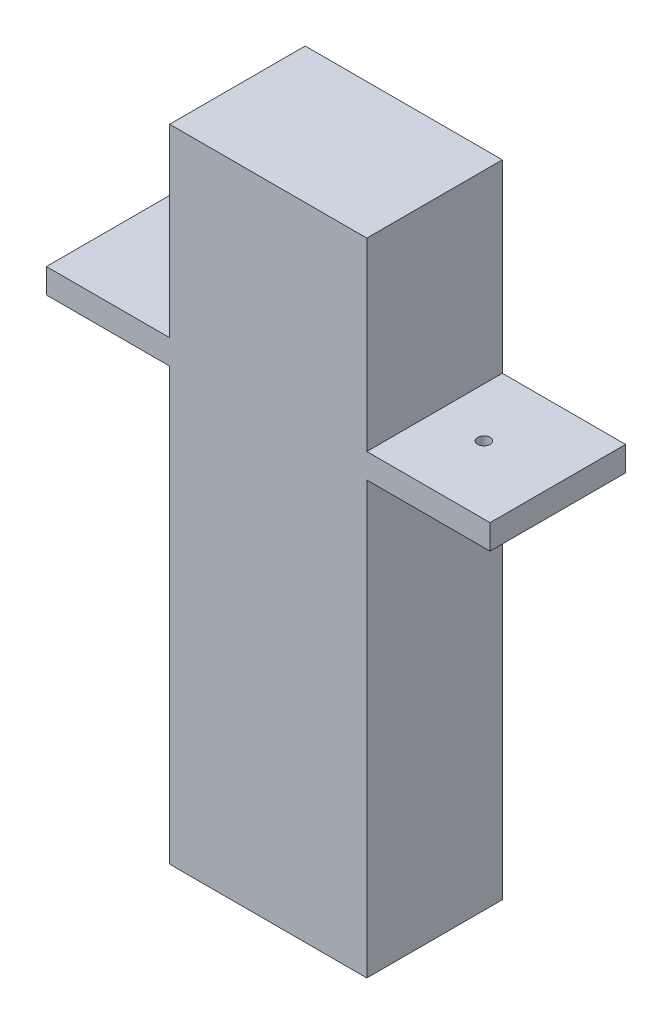
ISO-10303-21;
HEADER;
FILE_DESCRIPTION(('STEP AP214'),'2;1');
FILE_NAME('part.step','',(''),(''),'','','');
FILE_SCHEMA(('AUTOMOTIVE_DESIGN { 1 0 10303 214 1 1 1 1 }'));
ENDSEC;
DATA;
#1=APPLICATION_CONTEXT('core data for automotive mechanical design processes');
#2=APPLICATION_PROTOCOL_DEFINITION('international standard','automotive_design',2000,#1);
#3=PRODUCT_CONTEXT('',#1,'mechanical');
#4=PRODUCT('Part','Part','',(#3));
#5=PRODUCT_RELATED_PRODUCT_CATEGORY('part','',(#4));
#6=PRODUCT_DEFINITION_FORMATION('','',#4);
#7=PRODUCT_DEFINITION_CONTEXT('part definition',#1,'design');
#8=PRODUCT_DEFINITION('design','',#6,#7);
#9=PRODUCT_DEFINITION_SHAPE('','',#8);
#10=(LENGTH_UNIT() NAMED_UNIT(*) SI_UNIT(.MILLI.,.METRE.));
#11=(NAMED_UNIT(*) PLANE_ANGLE_UNIT() SI_UNIT($,.RADIAN.));
#12=(NAMED_UNIT(*) SI_UNIT($,.STERADIAN.) SOLID_ANGLE_UNIT());
#13=UNCERTAINTY_MEASURE_WITH_UNIT(LENGTH_MEASURE(1.E-05),#10,'distance_accuracy_value','');
#14=(GEOMETRIC_REPRESENTATION_CONTEXT(3) GLOBAL_UNCERTAINTY_ASSIGNED_CONTEXT((#13)) GLOBAL_UNIT_ASSIGNED_CONTEXT((#10,
#11,#12)) REPRESENTATION_CONTEXT('',''));
#15=CARTESIAN_POINT('',(0.,0.,0.));
#16=DIRECTION('',(0.,0.,1.));
#17=DIRECTION('',(1.,0.,0.));
#18=AXIS2_PLACEMENT_3D('',#15,#16,#17);
#19=CARTESIAN_POINT('',(8.,0.,9.));
#20=DIRECTION('',(-1.,0.,0.));
#21=DIRECTION('',(0.,0.,1.));
#22=AXIS2_PLACEMENT_3D('',#19,#20,#21);
#23=PLANE('',#22);
#24=DIRECTION('',(0.,1.,0.));
#25=VECTOR('',#24,1.);
#26=CARTESIAN_POINT('',(8.,0.,0.));
#27=LINE('',#26,#25);
#28=CARTESIAN_POINT('',(8.,-25.,0.));
#29=VERTEX_POINT('',#28);
#30=CARTESIAN_POINT('',(8.,10.,0.));
#31=VERTEX_POINT('',#30);
#32=EDGE_CURVE('E263',#29,#31,#27,.T.);
#33=ORIENTED_EDGE('',*,*,#32,.T.);
#34=DIRECTION('',(0.,0.,1.));
#35=VECTOR('',#34,1.);
#36=CARTESIAN_POINT('',(8.,10.,0.));
#37=LINE('',#36,#35);
#38=CARTESIAN_POINT('',(8.,10.,11.));
#39=VERTEX_POINT('',#38);
#40=EDGE_CURVE('E175',#31,#39,#37,.T.);
#41=ORIENTED_EDGE('',*,*,#40,.T.);
#42=DIRECTION('',(0.,1.,0.));
#43=VECTOR('',#42,1.);
#44=CARTESIAN_POINT('',(8.,27.,11.));
#45=LINE('',#44,#43);
#46=CARTESIAN_POINT('',(8.,-25.,11.));
#47=VERTEX_POINT('',#46);
#48=EDGE_CURVE('E240',#47,#39,#45,.T.);
#49=ORIENTED_EDGE('',*,*,#48,.F.);
#50=DIRECTION('',(0.,0.,-1.));
#51=VECTOR('',#50,1.);
#52=CARTESIAN_POINT('',(8.,-25.,9.));
#53=LINE('',#52,#51);
#54=EDGE_CURVE('E50',#47,#29,#53,.T.);
#55=ORIENTED_EDGE('',*,*,#54,.T.);
#56=EDGE_LOOP('',(#33,#41,#49,#55));
#57=FACE_BOUND('',#56,.T.);
#58=ADVANCED_FACE('F41',(#57),#23,.F.);
#59=CARTESIAN_POINT('',(-8.,0.,9.));
#60=DIRECTION('',(-1.,0.,0.));
#61=DIRECTION('',(0.,0.,1.));
#62=AXIS2_PLACEMENT_3D('',#59,#60,#61);
#63=PLANE('',#62);
#64=DIRECTION('',(0.,0.,-1.));
#65=VECTOR('',#64,1.);
#66=CARTESIAN_POINT('',(-8.,12.,0.));
#67=LINE('',#66,#65);
#68=CARTESIAN_POINT('',(-7.99999999999999,12.,11.));
#69=VERTEX_POINT('',#68);
#70=CARTESIAN_POINT('',(-8.,12.,0.));
#71=VERTEX_POINT('',#70);
#72=EDGE_CURVE('E65',#69,#71,#67,.T.);
#73=ORIENTED_EDGE('',*,*,#72,.F.);
#74=DIRECTION('',(0.,-1.,0.));
#75=VECTOR('',#74,1.);
#76=CARTESIAN_POINT('',(-8.,27.,11.));
#77=LINE('',#76,#75);
#78=CARTESIAN_POINT('',(-8.,27.,11.));
#79=VERTEX_POINT('',#78);
#80=EDGE_CURVE('E233',#79,#69,#77,.T.);
#81=ORIENTED_EDGE('',*,*,#80,.F.);
#82=DIRECTION('',(0.,0.,-1.));
#83=VECTOR('',#82,1.);
#84=CARTESIAN_POINT('',(-8.,27.,9.));
#85=LINE('',#84,#83);
#86=CARTESIAN_POINT('',(-8.,27.,0.));
#87=VERTEX_POINT('',#86);
#88=EDGE_CURVE('E289',#79,#87,#85,.T.);
#89=ORIENTED_EDGE('',*,*,#88,.T.);
#90=DIRECTION('',(0.,1.,0.));
#91=VECTOR('',#90,1.);
#92=CARTESIAN_POINT('',(-8.,0.,0.));
#93=LINE('',#92,#91);
#94=EDGE_CURVE('E268',#71,#87,#93,.T.);
#95=ORIENTED_EDGE('',*,*,#94,.F.);
#96=EDGE_LOOP('',(#73,#81,#89,#95));
#97=FACE_BOUND('',#96,.T.);
#98=ADVANCED_FACE('F343',(#97),#63,.T.);
#99=CARTESIAN_POINT('',(8.,12.,11.));
#100=VERTEX_POINT('',#99);
#101=CARTESIAN_POINT('',(8.,27.,11.));
#102=VERTEX_POINT('',#101);
#103=EDGE_CURVE('E239',#100,#102,#45,.T.);
#104=ORIENTED_EDGE('',*,*,#103,.F.);
#105=DIRECTION('',(0.,0.,-1.));
#106=VECTOR('',#105,1.);
#107=CARTESIAN_POINT('',(8.,12.,0.));
#108=LINE('',#107,#106);
#109=CARTESIAN_POINT('',(8.,12.,0.));
#110=VERTEX_POINT('',#109);
#111=EDGE_CURVE('E185',#100,#110,#108,.T.);
#112=ORIENTED_EDGE('',*,*,#111,.T.);
#113=CARTESIAN_POINT('',(8.,27.,0.));
#114=VERTEX_POINT('',#113);
#115=EDGE_CURVE('E163',#110,#114,#27,.T.);
#116=ORIENTED_EDGE('',*,*,#115,.T.);
#117=DIRECTION('',(0.,0.,-1.));
#118=VECTOR('',#117,1.);
#119=CARTESIAN_POINT('',(8.,27.,9.));
#120=LINE('',#119,#118);
#121=EDGE_CURVE('E292',#102,#114,#120,.T.);
#122=ORIENTED_EDGE('',*,*,#121,.F.);
#123=EDGE_LOOP('',(#104,#112,#116,#122));
#124=FACE_BOUND('',#123,.T.);
#125=ADVANCED_FACE('F43',(#124),#23,.F.);
#126=CARTESIAN_POINT('',(0.,27.,9.));
#127=DIRECTION('',(0.,1.,0.));
#128=DIRECTION('',(-1.,0.,0.));
#129=AXIS2_PLACEMENT_3D('',#126,#127,#128);
#130=PLANE('',#129);
#131=DIRECTION('',(1.,0.,0.));
#132=VECTOR('',#131,1.);
#133=CARTESIAN_POINT('',(0.,27.,0.));
#134=LINE('',#133,#132);
#135=EDGE_CURVE('E266',#87,#114,#134,.T.);
#136=ORIENTED_EDGE('',*,*,#135,.F.);
#137=ORIENTED_EDGE('',*,*,#88,.F.);
#138=DIRECTION('',(-1.,0.,0.));
#139=VECTOR('',#138,1.);
#140=CARTESIAN_POINT('',(-8.,27.,11.));
#141=LINE('',#140,#139);
#142=EDGE_CURVE('E243',#102,#79,#141,.T.);
#143=ORIENTED_EDGE('',*,*,#142,.F.);
#144=ORIENTED_EDGE('',*,*,#121,.T.);
#145=EDGE_LOOP('',(#136,#137,#143,#144));
#146=FACE_BOUND('',#145,.T.);
#147=ADVANCED_FACE('F349',(#146),#130,.T.);
#148=DIRECTION('',(0.,0.,1.));
#149=VECTOR('',#148,1.);
#150=CARTESIAN_POINT('',(-8.,10.,0.));
#151=LINE('',#150,#149);
#152=CARTESIAN_POINT('',(-8.,10.,0.));
#153=VERTEX_POINT('',#152);
#154=CARTESIAN_POINT('',(-8.,10.,11.));
#155=VERTEX_POINT('',#154);
#156=EDGE_CURVE('E198',#153,#155,#151,.T.);
#157=ORIENTED_EDGE('',*,*,#156,.F.);
#158=CARTESIAN_POINT('',(-8.,-25.,0.));
#159=VERTEX_POINT('',#158);
#160=EDGE_CURVE('E269',#159,#153,#93,.T.);
#161=ORIENTED_EDGE('',*,*,#160,.F.);
#162=DIRECTION('',(0.,0.,-1.));
#163=VECTOR('',#162,1.);
#164=CARTESIAN_POINT('',(-8.,-25.,9.));
#165=LINE('',#164,#163);
#166=CARTESIAN_POINT('',(-7.99999999999999,-25.,11.));
#167=VERTEX_POINT('',#166);
#168=EDGE_CURVE('E287',#167,#159,#165,.T.);
#169=ORIENTED_EDGE('',*,*,#168,.F.);
#170=EDGE_CURVE('E236',#155,#167,#77,.T.);
#171=ORIENTED_EDGE('',*,*,#170,.F.);
#172=EDGE_LOOP('',(#157,#161,#169,#171));
#173=FACE_BOUND('',#172,.T.);
#174=ADVANCED_FACE('F315',(#173),#63,.T.);
#175=CARTESIAN_POINT('',(0.,-25.,9.));
#176=DIRECTION('',(0.,1.,0.));
#177=DIRECTION('',(0.,0.,1.));
#178=AXIS2_PLACEMENT_3D('',#175,#176,#177);
#179=PLANE('',#178);
#180=DIRECTION('',(1.,0.,0.));
#181=VECTOR('',#180,1.);
#182=CARTESIAN_POINT('',(0.,-25.,0.));
#183=LINE('',#182,#181);
#184=CARTESIAN_POINT('',(-6.,-25.,0.));
#185=VERTEX_POINT('',#184);
#186=EDGE_CURVE('E262',#159,#185,#183,.T.);
#187=ORIENTED_EDGE('',*,*,#186,.T.);
#188=DIRECTION('',(0.,0.,-1.));
#189=VECTOR('',#188,1.);
#190=CARTESIAN_POINT('',(-6.,-25.,9.));
#191=LINE('',#190,#189);
#192=CARTESIAN_POINT('',(-6.,-25.,9.));
#193=VERTEX_POINT('',#192);
#194=EDGE_CURVE('E285',#193,#185,#191,.T.);
#195=ORIENTED_EDGE('',*,*,#194,.F.);
#196=DIRECTION('',(1.,0.,0.));
#197=VECTOR('',#196,1.);
#198=CARTESIAN_POINT('',(-7.99999999999999,-25.,9.));
#199=LINE('',#198,#197);
#200=CARTESIAN_POINT('',(6.,-25.,9.));
#201=VERTEX_POINT('',#200);
#202=EDGE_CURVE('E232',#193,#201,#199,.T.);
#203=ORIENTED_EDGE('',*,*,#202,.T.);
#204=DIRECTION('',(0.,0.,-1.));
#205=VECTOR('',#204,1.);
#206=CARTESIAN_POINT('',(6.,-25.,9.));
#207=LINE('',#206,#205);
#208=CARTESIAN_POINT('',(6.,-25.,0.));
#209=VERTEX_POINT('',#208);
#210=EDGE_CURVE('E259',#201,#209,#207,.T.);
#211=ORIENTED_EDGE('',*,*,#210,.T.);
#212=EDGE_CURVE('E246',#209,#29,#183,.T.);
#213=ORIENTED_EDGE('',*,*,#212,.T.);
#214=ORIENTED_EDGE('',*,*,#54,.F.);
#215=DIRECTION('',(1.,0.,0.));
#216=VECTOR('',#215,1.);
#217=CARTESIAN_POINT('',(-7.99999999999999,-25.,11.));
#218=LINE('',#217,#216);
#219=EDGE_CURVE('E235',#167,#47,#218,.T.);
#220=ORIENTED_EDGE('',*,*,#219,.F.);
#221=ORIENTED_EDGE('',*,*,#168,.T.);
#222=EDGE_LOOP('',(#187,#195,#203,#211,#213,#214,#220,#221));
#223=FACE_BOUND('',#222,.T.);
#224=ADVANCED_FACE('F301',(#223),#179,.F.);
#225=CARTESIAN_POINT('',(-6.,0.,9.));
#226=DIRECTION('',(1.,0.,0.));
#227=DIRECTION('',(0.,1.,0.));
#228=AXIS2_PLACEMENT_3D('',#225,#226,#227);
#229=PLANE('',#228);
#230=DIRECTION('',(0.,-1.,0.));
#231=VECTOR('',#230,1.);
#232=CARTESIAN_POINT('',(-6.,0.,0.));
#233=LINE('',#232,#231);
#234=CARTESIAN_POINT('',(-6.,25.,0.));
#235=VERTEX_POINT('',#234);
#236=EDGE_CURVE('E272',#235,#185,#233,.T.);
#237=ORIENTED_EDGE('',*,*,#236,.F.);
#238=DIRECTION('',(0.,0.,-1.));
#239=VECTOR('',#238,1.);
#240=CARTESIAN_POINT('',(-6.,25.,9.));
#241=LINE('',#240,#239);
#242=CARTESIAN_POINT('',(-6.,25.,9.));
#243=VERTEX_POINT('',#242);
#244=EDGE_CURVE('E283',#243,#235,#241,.T.);
#245=ORIENTED_EDGE('',*,*,#244,.F.);
#246=DIRECTION('',(0.,-1.,0.));
#247=VECTOR('',#246,1.);
#248=CARTESIAN_POINT('',(-6.,0.,9.));
#249=LINE('',#248,#247);
#250=EDGE_CURVE('E249',#243,#193,#249,.T.);
#251=ORIENTED_EDGE('',*,*,#250,.T.);
#252=ORIENTED_EDGE('',*,*,#194,.T.);
#253=EDGE_LOOP('',(#237,#245,#251,#252));
#254=FACE_BOUND('',#253,.T.);
#255=ADVANCED_FACE('F366',(#254),#229,.T.);
#256=CARTESIAN_POINT('',(0.,25.,9.));
#257=DIRECTION('',(0.,1.,0.));
#258=DIRECTION('',(0.,0.,1.));
#259=AXIS2_PLACEMENT_3D('',#256,#257,#258);
#260=PLANE('',#259);
#261=DIRECTION('',(1.,0.,0.));
#262=VECTOR('',#261,1.);
#263=CARTESIAN_POINT('',(0.,25.,0.));
#264=LINE('',#263,#262);
#265=CARTESIAN_POINT('',(6.,25.,0.));
#266=VERTEX_POINT('',#265);
#267=EDGE_CURVE('E275',#235,#266,#264,.T.);
#268=ORIENTED_EDGE('',*,*,#267,.T.);
#269=DIRECTION('',(0.,0.,-1.));
#270=VECTOR('',#269,1.);
#271=CARTESIAN_POINT('',(6.,25.,9.));
#272=LINE('',#271,#270);
#273=CARTESIAN_POINT('',(6.,25.,9.));
#274=VERTEX_POINT('',#273);
#275=EDGE_CURVE('E280',#274,#266,#272,.T.);
#276=ORIENTED_EDGE('',*,*,#275,.F.);
#277=DIRECTION('',(1.,0.,0.));
#278=VECTOR('',#277,1.);
#279=CARTESIAN_POINT('',(0.,25.,9.));
#280=LINE('',#279,#278);
#281=EDGE_CURVE('E252',#243,#274,#280,.T.);
#282=ORIENTED_EDGE('',*,*,#281,.F.);
#283=ORIENTED_EDGE('',*,*,#244,.T.);
#284=EDGE_LOOP('',(#268,#276,#282,#283));
#285=FACE_BOUND('',#284,.T.);
#286=ADVANCED_FACE('F369',(#285),#260,.F.);
#287=CARTESIAN_POINT('',(6.,0.,9.));
#288=DIRECTION('',(1.,0.,0.));
#289=DIRECTION('',(0.,1.,0.));
#290=AXIS2_PLACEMENT_3D('',#287,#288,#289);
#291=PLANE('',#290);
#292=DIRECTION('',(0.,-1.,0.));
#293=VECTOR('',#292,1.);
#294=CARTESIAN_POINT('',(6.,0.,0.));
#295=LINE('',#294,#293);
#296=EDGE_CURVE('E253',#266,#209,#295,.T.);
#297=ORIENTED_EDGE('',*,*,#296,.T.);
#298=ORIENTED_EDGE('',*,*,#210,.F.);
#299=DIRECTION('',(0.,-1.,0.));
#300=VECTOR('',#299,1.);
#301=CARTESIAN_POINT('',(6.,0.,9.));
#302=LINE('',#301,#300);
#303=EDGE_CURVE('E256',#274,#201,#302,.T.);
#304=ORIENTED_EDGE('',*,*,#303,.F.);
#305=ORIENTED_EDGE('',*,*,#275,.T.);
#306=EDGE_LOOP('',(#297,#298,#304,#305));
#307=FACE_BOUND('',#306,.T.);
#308=ADVANCED_FACE('F373',(#307),#291,.F.);
#309=CARTESIAN_POINT('',(0.,0.,0.));
#310=DIRECTION('',(0.,0.,1.));
#311=DIRECTION('',(1.,0.,0.));
#312=AXIS2_PLACEMENT_3D('',#309,#310,#311);
#313=PLANE('',#312);
#314=ORIENTED_EDGE('',*,*,#212,.F.);
#315=ORIENTED_EDGE('',*,*,#296,.F.);
#316=ORIENTED_EDGE('',*,*,#267,.F.);
#317=ORIENTED_EDGE('',*,*,#236,.T.);
#318=ORIENTED_EDGE('',*,*,#186,.F.);
#319=ORIENTED_EDGE('',*,*,#160,.T.);
#320=DIRECTION('',(1.,0.,0.));
#321=VECTOR('',#320,1.);
#322=CARTESIAN_POINT('',(-18.,10.,0.));
#323=LINE('',#322,#321);
#324=CARTESIAN_POINT('',(-18.,10.,0.));
#325=VERTEX_POINT('',#324);
#326=EDGE_CURVE('E220',#325,#153,#323,.T.);
#327=ORIENTED_EDGE('',*,*,#326,.F.);
#328=DIRECTION('',(0.,-1.,0.));
#329=VECTOR('',#328,1.);
#330=CARTESIAN_POINT('',(-18.,12.,0.));
#331=LINE('',#330,#329);
#332=CARTESIAN_POINT('',(-18.,12.,0.));
#333=VERTEX_POINT('',#332);
#334=EDGE_CURVE('E199',#333,#325,#331,.T.);
#335=ORIENTED_EDGE('',*,*,#334,.F.);
#336=DIRECTION('',(1.,0.,0.));
#337=VECTOR('',#336,1.);
#338=CARTESIAN_POINT('',(-18.,12.,0.));
#339=LINE('',#338,#337);
#340=EDGE_CURVE('E208',#333,#71,#339,.T.);
#341=ORIENTED_EDGE('',*,*,#340,.T.);
#342=ORIENTED_EDGE('',*,*,#94,.T.);
#343=ORIENTED_EDGE('',*,*,#135,.T.);
#344=ORIENTED_EDGE('',*,*,#115,.F.);
#345=DIRECTION('',(-1.,0.,0.));
#346=VECTOR('',#345,1.);
#347=CARTESIAN_POINT('',(18.,12.,0.));
#348=LINE('',#347,#346);
#349=CARTESIAN_POINT('',(18.,12.,0.));
#350=VERTEX_POINT('',#349);
#351=EDGE_CURVE('E57',#350,#110,#348,.T.);
#352=ORIENTED_EDGE('',*,*,#351,.F.);
#353=DIRECTION('',(0.,-1.,0.));
#354=VECTOR('',#353,1.);
#355=CARTESIAN_POINT('',(18.,12.,0.));
#356=LINE('',#355,#354);
#357=CARTESIAN_POINT('',(18.,10.,0.));
#358=VERTEX_POINT('',#357);
#359=EDGE_CURVE('E160',#350,#358,#356,.T.);
#360=ORIENTED_EDGE('',*,*,#359,.T.);
#361=DIRECTION('',(-1.,0.,0.));
#362=VECTOR('',#361,1.);
#363=CARTESIAN_POINT('',(18.,10.,0.));
#364=LINE('',#363,#362);
#365=EDGE_CURVE('E184',#358,#31,#364,.T.);
#366=ORIENTED_EDGE('',*,*,#365,.T.);
#367=ORIENTED_EDGE('',*,*,#32,.F.);
#368=EDGE_LOOP('',(#314,#315,#316,#317,#318,#319,#327,#335,#341,#342,#343,#344,#352,#360,#366,#367));
#369=FACE_BOUND('',#368,.T.);
#370=ADVANCED_FACE('F159',(#369),#313,.F.);
#371=CARTESIAN_POINT('',(0.,0.,11.));
#372=DIRECTION('',(0.,0.,1.));
#373=DIRECTION('',(1.,0.,0.));
#374=AXIS2_PLACEMENT_3D('',#371,#372,#373);
#375=PLANE('',#374);
#376=ORIENTED_EDGE('',*,*,#80,.T.);
#377=DIRECTION('',(1.,0.,0.));
#378=VECTOR('',#377,1.);
#379=CARTESIAN_POINT('',(-18.,12.,11.));
#380=LINE('',#379,#378);
#381=CARTESIAN_POINT('',(-18.,12.,11.));
#382=VERTEX_POINT('',#381);
#383=EDGE_CURVE('E214',#382,#69,#380,.T.);
#384=ORIENTED_EDGE('',*,*,#383,.F.);
#385=DIRECTION('',(0.,1.,0.));
#386=VECTOR('',#385,1.);
#387=CARTESIAN_POINT('',(-18.,12.,11.));
#388=LINE('',#387,#386);
#389=CARTESIAN_POINT('',(-18.,10.,11.));
#390=VERTEX_POINT('',#389);
#391=EDGE_CURVE('E204',#390,#382,#388,.T.);
#392=ORIENTED_EDGE('',*,*,#391,.F.);
#393=DIRECTION('',(1.,0.,0.));
#394=VECTOR('',#393,1.);
#395=CARTESIAN_POINT('',(-18.,10.,11.));
#396=LINE('',#395,#394);
#397=EDGE_CURVE('E217',#390,#155,#396,.T.);
#398=ORIENTED_EDGE('',*,*,#397,.T.);
#399=ORIENTED_EDGE('',*,*,#170,.T.);
#400=ORIENTED_EDGE('',*,*,#219,.T.);
#401=ORIENTED_EDGE('',*,*,#48,.T.);
#402=DIRECTION('',(-1.,0.,0.));
#403=VECTOR('',#402,1.);
#404=CARTESIAN_POINT('',(18.,10.,11.));
#405=LINE('',#404,#403);
#406=CARTESIAN_POINT('',(18.,10.,11.));
#407=VERTEX_POINT('',#406);
#408=EDGE_CURVE('E190',#407,#39,#405,.T.);
#409=ORIENTED_EDGE('',*,*,#408,.F.);
#410=DIRECTION('',(0.,1.,0.));
#411=VECTOR('',#410,1.);
#412=CARTESIAN_POINT('',(18.,12.,11.));
#413=LINE('',#412,#411);
#414=CARTESIAN_POINT('',(18.,12.,11.));
#415=VERTEX_POINT('',#414);
#416=EDGE_CURVE('E178',#407,#415,#413,.T.);
#417=ORIENTED_EDGE('',*,*,#416,.T.);
#418=DIRECTION('',(-1.,0.,0.));
#419=VECTOR('',#418,1.);
#420=CARTESIAN_POINT('',(18.,12.,11.));
#421=LINE('',#420,#419);
#422=EDGE_CURVE('E165',#415,#100,#421,.T.);
#423=ORIENTED_EDGE('',*,*,#422,.T.);
#424=ORIENTED_EDGE('',*,*,#103,.T.);
#425=ORIENTED_EDGE('',*,*,#142,.T.);
#426=EDGE_LOOP('',(#376,#384,#392,#398,#399,#400,#401,#409,#417,#423,#424,#425));
#427=FACE_BOUND('',#426,.T.);
#428=ADVANCED_FACE('F308',(#427),#375,.T.);
#429=CARTESIAN_POINT('',(0.,0.,9.));
#430=DIRECTION('',(0.,0.,1.));
#431=DIRECTION('',(1.,0.,0.));
#432=AXIS2_PLACEMENT_3D('',#429,#430,#431);
#433=PLANE('',#432);
#434=CARTESIAN_POINT('',(0.,4.,9.));
#435=DIRECTION('',(0.,0.,1.));
#436=DIRECTION('',(1.,0.,0.));
#437=AXIS2_PLACEMENT_3D('',#434,#435,#436);
#438=CIRCLE('',#437,1.75);
#439=CARTESIAN_POINT('',(1.75,4.,9.));
#440=VERTEX_POINT('',#439);
#441=EDGE_CURVE('E11',#440,#440,#438,.F.);
#442=ORIENTED_EDGE('',*,*,#441,.F.);
#443=EDGE_LOOP('',(#442));
#444=FACE_BOUND('',#443,.T.);
#445=ORIENTED_EDGE('',*,*,#250,.F.);
#446=ORIENTED_EDGE('',*,*,#281,.T.);
#447=ORIENTED_EDGE('',*,*,#303,.T.);
#448=ORIENTED_EDGE('',*,*,#202,.F.);
#449=EDGE_LOOP('',(#445,#446,#447,#448));
#450=FACE_BOUND('',#449,.T.);
#451=ADVANCED_FACE('F379',(#444,#450),#433,.F.);
#452=CARTESIAN_POINT('',(0.,4.,4.));
#453=DIRECTION('',(0.,0.,1.));
#454=DIRECTION('',(1.,0.,0.));
#455=AXIS2_PLACEMENT_3D('',#452,#453,#454);
#456=CYLINDRICAL_SURFACE('',#455,1.75);
#457=CARTESIAN_POINT('',(0.,4.,4.));
#458=DIRECTION('',(0.,0.,-1.));
#459=DIRECTION('',(-1.,0.,0.));
#460=AXIS2_PLACEMENT_3D('',#457,#458,#459);
#461=CIRCLE('',#460,1.75);
#462=CARTESIAN_POINT('',(-1.75,4.,4.));
#463=VERTEX_POINT('',#462);
#464=EDGE_CURVE('E227',#463,#463,#461,.T.);
#465=ORIENTED_EDGE('',*,*,#464,.F.);
#466=EDGE_LOOP('',(#465));
#467=FACE_BOUND('',#466,.T.);
#468=ORIENTED_EDGE('',*,*,#441,.T.);
#469=EDGE_LOOP('',(#468));
#470=FACE_BOUND('',#469,.T.);
#471=ADVANCED_FACE('F382',(#467,#470),#456,.T.);
#472=CARTESIAN_POINT('',(0.,4.,4.));
#473=DIRECTION('',(0.,0.,-1.));
#474=DIRECTION('',(-1.,0.,0.));
#475=AXIS2_PLACEMENT_3D('',#472,#473,#474);
#476=PLANE('',#475);
#477=CARTESIAN_POINT('',(0.,4.,4.));
#478=DIRECTION('',(0.,0.,-1.));
#479=DIRECTION('',(-1.,0.,0.));
#480=AXIS2_PLACEMENT_3D('',#477,#478,#479);
#481=CIRCLE('',#480,0.5);
#482=CARTESIAN_POINT('',(-0.5,4.,4.));
#483=VERTEX_POINT('',#482);
#484=EDGE_CURVE('E223',#483,#483,#481,.T.);
#485=ORIENTED_EDGE('',*,*,#484,.F.);
#486=EDGE_LOOP('',(#485));
#487=FACE_BOUND('',#486,.T.);
#488=ORIENTED_EDGE('',*,*,#464,.T.);
#489=EDGE_LOOP('',(#488));
#490=FACE_BOUND('',#489,.T.);
#491=ADVANCED_FACE('F388',(#487,#490),#476,.T.);
#492=CARTESIAN_POINT('',(0.,4.,9.));
#493=DIRECTION('',(0.,0.,-1.));
#494=DIRECTION('',(-1.,0.,0.));
#495=AXIS2_PLACEMENT_3D('',#492,#493,#494);
#496=CYLINDRICAL_SURFACE('',#495,0.5);
#497=CARTESIAN_POINT('',(0.,4.,9.));
#498=DIRECTION('',(0.,0.,-1.));
#499=DIRECTION('',(-1.,0.,0.));
#500=AXIS2_PLACEMENT_3D('',#497,#498,#499);
#501=CIRCLE('',#500,0.5);
#502=CARTESIAN_POINT('',(-0.5,4.,9.));
#503=VERTEX_POINT('',#502);
#504=EDGE_CURVE('E224',#503,#503,#501,.T.);
#505=ORIENTED_EDGE('',*,*,#504,.F.);
#506=EDGE_LOOP('',(#505));
#507=FACE_BOUND('',#506,.T.);
#508=ORIENTED_EDGE('',*,*,#484,.T.);
#509=EDGE_LOOP('',(#508));
#510=FACE_BOUND('',#509,.T.);
#511=ADVANCED_FACE('F392',(#507,#510),#496,.F.);
#512=CARTESIAN_POINT('',(0.,4.,9.));
#513=DIRECTION('',(0.,0.,-1.));
#514=DIRECTION('',(-1.,0.,0.));
#515=AXIS2_PLACEMENT_3D('',#512,#513,#514);
#516=PLANE('',#515);
#517=ORIENTED_EDGE('',*,*,#504,.T.);
#518=EDGE_LOOP('',(#517));
#519=FACE_BOUND('',#518,.T.);
#520=ADVANCED_FACE('F338',(#519),#516,.T.);
#521=CARTESIAN_POINT('',(-18.,10.,0.));
#522=DIRECTION('',(0.,1.,0.));
#523=DIRECTION('',(0.,0.,1.));
#524=AXIS2_PLACEMENT_3D('',#521,#522,#523);
#525=PLANE('',#524);
#526=CARTESIAN_POINT('',(-12.,9.99999999999999,5.5));
#527=DIRECTION('',(0.,1.,0.));
#528=DIRECTION('',(0.,0.,1.));
#529=AXIS2_PLACEMENT_3D('',#526,#527,#528);
#530=CIRCLE('',#529,0.500000000000001);
#531=CARTESIAN_POINT('',(-12.,9.99999999999999,6.));
#532=VERTEX_POINT('',#531);
#533=EDGE_CURVE('E195',#532,#532,#530,.T.);
#534=ORIENTED_EDGE('',*,*,#533,.T.);
#535=EDGE_LOOP('',(#534));
#536=FACE_BOUND('',#535,.T.);
#537=ORIENTED_EDGE('',*,*,#156,.T.);
#538=ORIENTED_EDGE('',*,*,#397,.F.);
#539=DIRECTION('',(0.,0.,1.));
#540=VECTOR('',#539,1.);
#541=CARTESIAN_POINT('',(-18.,10.,0.));
#542=LINE('',#541,#540);
#543=EDGE_CURVE('E202',#325,#390,#542,.T.);
#544=ORIENTED_EDGE('',*,*,#543,.F.);
#545=ORIENTED_EDGE('',*,*,#326,.T.);
#546=EDGE_LOOP('',(#537,#538,#544,#545));
#547=FACE_BOUND('',#546,.T.);
#548=ADVANCED_FACE('F318',(#536,#547),#525,.F.);
#549=CARTESIAN_POINT('',(-18.,12.,0.));
#550=DIRECTION('',(0.,-1.,0.));
#551=DIRECTION('',(0.,0.,-1.));
#552=AXIS2_PLACEMENT_3D('',#549,#550,#551);
#553=PLANE('',#552);
#554=CARTESIAN_POINT('',(-12.,12.,5.5));
#555=DIRECTION('',(0.,1.,0.));
#556=DIRECTION('',(0.,0.,1.));
#557=AXIS2_PLACEMENT_3D('',#554,#555,#556);
#558=CIRCLE('',#557,0.500000000000001);
#559=CARTESIAN_POINT('',(-12.,12.,6.));
#560=VERTEX_POINT('',#559);
#561=EDGE_CURVE('E164',#560,#560,#558,.T.);
#562=ORIENTED_EDGE('',*,*,#561,.F.);
#563=EDGE_LOOP('',(#562));
#564=FACE_BOUND('',#563,.T.);
#565=ORIENTED_EDGE('',*,*,#72,.T.);
#566=ORIENTED_EDGE('',*,*,#340,.F.);
#567=DIRECTION('',(0.,0.,-1.));
#568=VECTOR('',#567,1.);
#569=CARTESIAN_POINT('',(-18.,12.,0.));
#570=LINE('',#569,#568);
#571=EDGE_CURVE('E206',#382,#333,#570,.T.);
#572=ORIENTED_EDGE('',*,*,#571,.F.);
#573=ORIENTED_EDGE('',*,*,#383,.T.);
#574=EDGE_LOOP('',(#565,#566,#572,#573));
#575=FACE_BOUND('',#574,.T.);
#576=ADVANCED_FACE('F327',(#564,#575),#553,.F.);
#577=CARTESIAN_POINT('',(-18.,0.,0.));
#578=DIRECTION('',(-1.,0.,0.));
#579=DIRECTION('',(0.,0.,1.));
#580=AXIS2_PLACEMENT_3D('',#577,#578,#579);
#581=PLANE('',#580);
#582=ORIENTED_EDGE('',*,*,#334,.T.);
#583=ORIENTED_EDGE('',*,*,#543,.T.);
#584=ORIENTED_EDGE('',*,*,#391,.T.);
#585=ORIENTED_EDGE('',*,*,#571,.T.);
#586=EDGE_LOOP('',(#582,#583,#584,#585));
#587=FACE_BOUND('',#586,.T.);
#588=ADVANCED_FACE('F323',(#587),#581,.T.);
#589=CARTESIAN_POINT('',(-12.,-25.,5.50000000000001));
#590=DIRECTION('',(0.,1.,0.));
#591=DIRECTION('',(0.,0.,1.));
#592=AXIS2_PLACEMENT_3D('',#589,#590,#591);
#593=CYLINDRICAL_SURFACE('',#592,0.500000000000001);
#594=ORIENTED_EDGE('',*,*,#561,.T.);
#595=EDGE_LOOP('',(#594));
#596=FACE_BOUND('',#595,.T.);
#597=ORIENTED_EDGE('',*,*,#533,.F.);
#598=EDGE_LOOP('',(#597));
#599=FACE_BOUND('',#598,.T.);
#600=ADVANCED_FACE('F336',(#596,#599),#593,.F.);
#601=CARTESIAN_POINT('',(18.,12.,0.));
#602=DIRECTION('',(0.,1.,0.));
#603=DIRECTION('',(0.,0.,1.));
#604=AXIS2_PLACEMENT_3D('',#601,#602,#603);
#605=PLANE('',#604);
#606=CARTESIAN_POINT('',(12.,12.,5.5));
#607=DIRECTION('',(0.,-1.,0.));
#608=DIRECTION('',(0.,0.,1.));
#609=AXIS2_PLACEMENT_3D('',#606,#607,#608);
#610=CIRCLE('',#609,0.500000000000001);
#611=CARTESIAN_POINT('',(12.,12.,6.));
#612=VERTEX_POINT('',#611);
#613=EDGE_CURVE('E596',#612,#612,#610,.T.);
#614=ORIENTED_EDGE('',*,*,#613,.T.);
#615=EDGE_LOOP('',(#614));
#616=FACE_BOUND('',#615,.T.);
#617=ORIENTED_EDGE('',*,*,#111,.F.);
#618=ORIENTED_EDGE('',*,*,#422,.F.);
#619=DIRECTION('',(0.,0.,-1.));
#620=VECTOR('',#619,1.);
#621=CARTESIAN_POINT('',(18.,12.,0.));
#622=LINE('',#621,#620);
#623=EDGE_CURVE('E171',#415,#350,#622,.T.);
#624=ORIENTED_EDGE('',*,*,#623,.T.);
#625=ORIENTED_EDGE('',*,*,#351,.T.);
#626=EDGE_LOOP('',(#617,#618,#624,#625));
#627=FACE_BOUND('',#626,.T.);
#628=ADVANCED_FACE('F177',(#616,#627),#605,.T.);
#629=CARTESIAN_POINT('',(18.,10.,0.));
#630=DIRECTION('',(0.,-1.,0.));
#631=DIRECTION('',(0.,0.,-1.));
#632=AXIS2_PLACEMENT_3D('',#629,#630,#631);
#633=PLANE('',#632);
#634=CARTESIAN_POINT('',(12.,9.99999999999999,5.5));
#635=DIRECTION('',(0.,-1.,0.));
#636=DIRECTION('',(0.,0.,-1.));
#637=AXIS2_PLACEMENT_3D('',#634,#635,#636);
#638=CIRCLE('',#637,0.500000000000001);
#639=CARTESIAN_POINT('',(12.,9.99999999999999,5.));
#640=VERTEX_POINT('',#639);
#641=EDGE_CURVE('E45',#640,#640,#638,.F.);
#642=ORIENTED_EDGE('',*,*,#641,.T.);
#643=EDGE_LOOP('',(#642));
#644=FACE_BOUND('',#643,.T.);
#645=ORIENTED_EDGE('',*,*,#40,.F.);
#646=ORIENTED_EDGE('',*,*,#365,.F.);
#647=DIRECTION('',(0.,0.,1.));
#648=VECTOR('',#647,1.);
#649=CARTESIAN_POINT('',(18.,10.,0.));
#650=LINE('',#649,#648);
#651=EDGE_CURVE('E174',#358,#407,#650,.T.);
#652=ORIENTED_EDGE('',*,*,#651,.T.);
#653=ORIENTED_EDGE('',*,*,#408,.T.);
#654=EDGE_LOOP('',(#645,#646,#652,#653));
#655=FACE_BOUND('',#654,.T.);
#656=ADVANCED_FACE('F306',(#644,#655),#633,.T.);
#657=CARTESIAN_POINT('',(18.,0.,0.));
#658=DIRECTION('',(1.,0.,0.));
#659=DIRECTION('',(0.,0.,1.));
#660=AXIS2_PLACEMENT_3D('',#657,#658,#659);
#661=PLANE('',#660);
#662=ORIENTED_EDGE('',*,*,#359,.F.);
#663=ORIENTED_EDGE('',*,*,#623,.F.);
#664=ORIENTED_EDGE('',*,*,#416,.F.);
#665=ORIENTED_EDGE('',*,*,#651,.F.);
#666=EDGE_LOOP('',(#662,#663,#664,#665));
#667=FACE_BOUND('',#666,.T.);
#668=ADVANCED_FACE('F169',(#667),#661,.T.);
#669=CARTESIAN_POINT('',(12.,-25.,5.50000000000001));
#670=DIRECTION('',(0.,1.,0.));
#671=DIRECTION('',(0.,0.,1.));
#672=AXIS2_PLACEMENT_3D('',#669,#670,#671);
#673=CYLINDRICAL_SURFACE('',#672,0.500000000000001);
#674=ORIENTED_EDGE('',*,*,#641,.F.);
#675=EDGE_LOOP('',(#674));
#676=FACE_BOUND('',#675,.T.);
#677=ORIENTED_EDGE('',*,*,#613,.F.);
#678=EDGE_LOOP('',(#677));
#679=FACE_BOUND('',#678,.T.);
#680=ADVANCED_FACE('F485',(#676,#679),#673,.F.);
#681=CLOSED_SHELL('',(#58,#98,#125,#147,#174,#224,#255,#286,#308,#370,#428,#451,#471,#491,#511,
#520,#548,#576,#588,#600,#628,#656,#668,#680));
#682=MANIFOLD_SOLID_BREP('B2',#681);
#683=ADVANCED_BREP_SHAPE_REPRESENTATION('',(#18,#682),#14);
#684=SHAPE_DEFINITION_REPRESENTATION(#9,#683);
ENDSEC;
END-ISO-10303-21;
